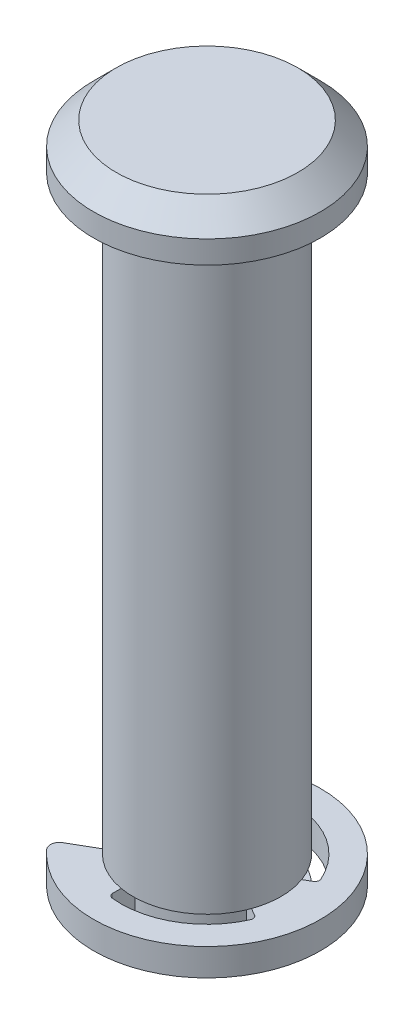
ISO-10303-21;
HEADER;
FILE_DESCRIPTION(('STEP AP214'),'2;1');
FILE_NAME('part.step','',(''),(''),'','','');
FILE_SCHEMA(('AUTOMOTIVE_DESIGN { 1 0 10303 214 1 1 1 1 }'));
ENDSEC;
DATA;
#1=APPLICATION_CONTEXT('core data for automotive mechanical design processes');
#2=APPLICATION_PROTOCOL_DEFINITION('international standard','automotive_design',2000,#1);
#3=PRODUCT_CONTEXT('',#1,'mechanical');
#4=PRODUCT('Part','Part','',(#3));
#5=PRODUCT_RELATED_PRODUCT_CATEGORY('part','',(#4));
#6=PRODUCT_DEFINITION_FORMATION('','',#4);
#7=PRODUCT_DEFINITION_CONTEXT('part definition',#1,'design');
#8=PRODUCT_DEFINITION('design','',#6,#7);
#9=PRODUCT_DEFINITION_SHAPE('','',#8);
#10=(LENGTH_UNIT() NAMED_UNIT(*) SI_UNIT(.MILLI.,.METRE.));
#11=(NAMED_UNIT(*) PLANE_ANGLE_UNIT() SI_UNIT($,.RADIAN.));
#12=(NAMED_UNIT(*) SI_UNIT($,.STERADIAN.) SOLID_ANGLE_UNIT());
#13=UNCERTAINTY_MEASURE_WITH_UNIT(LENGTH_MEASURE(1.E-05),#10,'distance_accuracy_value','');
#14=(GEOMETRIC_REPRESENTATION_CONTEXT(3) GLOBAL_UNCERTAINTY_ASSIGNED_CONTEXT((#13)) GLOBAL_UNIT_ASSIGNED_CONTEXT((#10,
#11,#12)) REPRESENTATION_CONTEXT('',''));
#15=CARTESIAN_POINT('',(0.,0.,0.));
#16=DIRECTION('',(0.,0.,1.));
#17=DIRECTION('',(1.,0.,0.));
#18=AXIS2_PLACEMENT_3D('',#15,#16,#17);
#19=CARTESIAN_POINT('',(0.,-1.524,0.));
#20=DIRECTION('',(0.,-1.,0.));
#21=DIRECTION('',(0.,0.,-1.));
#22=AXIS2_PLACEMENT_3D('',#19,#20,#21);
#23=PLANE('',#22);
#24=CARTESIAN_POINT('',(0.,-1.524,0.));
#25=DIRECTION('',(0.,1.,0.));
#26=DIRECTION('',(0.,0.,1.));
#27=AXIS2_PLACEMENT_3D('',#24,#25,#26);
#28=CIRCLE('',#27,2.0701);
#29=CARTESIAN_POINT('',(0.,-1.524,2.0701));
#30=VERTEX_POINT('',#29);
#31=EDGE_CURVE('P0_E18',#30,#30,#28,.T.);
#32=ORIENTED_EDGE('',*,*,#31,.F.);
#33=EDGE_LOOP('',(#32));
#34=FACE_BOUND('',#33,.T.);
#35=ADVANCED_FACE('P0_F15',(#34),#23,.T.);
#36=CARTESIAN_POINT('',(0.,17.78,0.));
#37=DIRECTION('',(0.,1.,0.));
#38=DIRECTION('',(0.,0.,1.));
#39=AXIS2_PLACEMENT_3D('',#36,#37,#38);
#40=PLANE('',#39);
#41=CARTESIAN_POINT('',(0.,17.7799999999593,0.));
#42=DIRECTION('',(0.,-1.,0.));
#43=DIRECTION('',(0.,0.,-1.));
#44=AXIS2_PLACEMENT_3D('',#41,#42,#43);
#45=CIRCLE('',#44,2.53999999995358);
#46=CARTESIAN_POINT('',(0.,17.7799999999593,-2.53999999995358));
#47=VERTEX_POINT('',#46);
#48=EDGE_CURVE('P0_E42',#47,#47,#45,.T.);
#49=ORIENTED_EDGE('',*,*,#48,.F.);
#50=EDGE_LOOP('',(#49));
#51=FACE_BOUND('',#50,.T.);
#52=ADVANCED_FACE('P0_F53',(#51),#40,.T.);
#53=CARTESIAN_POINT('',(0.,-1.524,0.));
#54=DIRECTION('',(0.,1.,0.));
#55=DIRECTION('',(0.,0.,1.));
#56=AXIS2_PLACEMENT_3D('',#53,#54,#55);
#57=CYLINDRICAL_SURFACE('',#56,2.0701);
#58=ORIENTED_EDGE('',*,*,#31,.T.);
#59=EDGE_LOOP('',(#58));
#60=FACE_BOUND('',#59,.T.);
#61=CARTESIAN_POINT('',(0.,-0.762,0.));
#62=DIRECTION('',(0.,1.,0.));
#63=DIRECTION('',(0.,0.,1.));
#64=AXIS2_PLACEMENT_3D('',#61,#62,#63);
#65=CIRCLE('',#64,2.0701);
#66=CARTESIAN_POINT('',(0.,-0.762,2.0701));
#67=VERTEX_POINT('',#66);
#68=EDGE_CURVE('P0_E40',#67,#67,#65,.F.);
#69=ORIENTED_EDGE('',*,*,#68,.T.);
#70=EDGE_LOOP('',(#69));
#71=FACE_BOUND('',#70,.T.);
#72=ADVANCED_FACE('P0_F49',(#60,#71),#57,.T.);
#73=CARTESIAN_POINT('',(0.,17.1450000000846,0.));
#74=DIRECTION('',(0.,-1.,0.));
#75=DIRECTION('',(0.,0.,-1.));
#76=AXIS2_PLACEMENT_3D('',#73,#74,#75);
#77=CONICAL_SURFACE('',#76,3.17499999988513,0.785398163442207);
#78=ORIENTED_EDGE('',*,*,#48,.T.);
#79=EDGE_LOOP('',(#78));
#80=FACE_BOUND('',#79,.T.);
#81=CARTESIAN_POINT('',(0.,17.145,0.));
#82=DIRECTION('',(0.,-1.,0.));
#83=DIRECTION('',(0.,0.,-1.));
#84=AXIS2_PLACEMENT_3D('',#81,#82,#83);
#85=CIRCLE('',#84,3.175);
#86=CARTESIAN_POINT('',(0.,17.145,-3.175));
#87=VERTEX_POINT('',#86);
#88=EDGE_CURVE('P0_E30',#87,#87,#85,.T.);
#89=ORIENTED_EDGE('',*,*,#88,.F.);
#90=EDGE_LOOP('',(#89));
#91=FACE_BOUND('',#90,.T.);
#92=ADVANCED_FACE('P0_F85',(#80,#91),#77,.T.);
#93=CARTESIAN_POINT('',(0.,-0.762,0.));
#94=DIRECTION('',(0.,-1.,0.));
#95=DIRECTION('',(0.,0.,-1.));
#96=AXIS2_PLACEMENT_3D('',#93,#94,#95);
#97=PLANE('',#96);
#98=ORIENTED_EDGE('',*,*,#68,.F.);
#99=EDGE_LOOP('',(#98));
#100=FACE_BOUND('',#99,.T.);
#101=CARTESIAN_POINT('',(0.,-0.762,0.));
#102=DIRECTION('',(0.,1.,0.));
#103=DIRECTION('',(0.,0.,1.));
#104=AXIS2_PLACEMENT_3D('',#101,#102,#103);
#105=CIRCLE('',#104,1.6891);
#106=CARTESIAN_POINT('',(0.,-0.762,1.6891));
#107=VERTEX_POINT('',#106);
#108=EDGE_CURVE('P0_E37',#107,#107,#105,.T.);
#109=ORIENTED_EDGE('',*,*,#108,.F.);
#110=EDGE_LOOP('',(#109));
#111=FACE_BOUND('',#110,.T.);
#112=ADVANCED_FACE('P0_F81',(#100,#111),#97,.F.);
#113=CARTESIAN_POINT('',(0.,17.78,0.));
#114=DIRECTION('',(0.,-1.,0.));
#115=DIRECTION('',(0.,0.,-1.));
#116=AXIS2_PLACEMENT_3D('',#113,#114,#115);
#117=CYLINDRICAL_SURFACE('',#116,3.175);
#118=ORIENTED_EDGE('',*,*,#88,.T.);
#119=EDGE_LOOP('',(#118));
#120=FACE_BOUND('',#119,.T.);
#121=CARTESIAN_POINT('',(0.,16.51,0.));
#122=DIRECTION('',(0.,-1.,0.));
#123=DIRECTION('',(0.,0.,-1.));
#124=AXIS2_PLACEMENT_3D('',#121,#122,#123);
#125=CIRCLE('',#124,3.175);
#126=CARTESIAN_POINT('',(0.,16.51,-3.175));
#127=VERTEX_POINT('',#126);
#128=EDGE_CURVE('P0_E34',#127,#127,#125,.F.);
#129=ORIENTED_EDGE('',*,*,#128,.T.);
#130=EDGE_LOOP('',(#129));
#131=FACE_BOUND('',#130,.T.);
#132=ADVANCED_FACE('P0_F77',(#120,#131),#117,.T.);
#133=CARTESIAN_POINT('',(0.,-0.762,0.));
#134=DIRECTION('',(0.,1.,0.));
#135=DIRECTION('',(0.,0.,1.));
#136=AXIS2_PLACEMENT_3D('',#133,#134,#135);
#137=CYLINDRICAL_SURFACE('',#136,1.6891);
#138=ORIENTED_EDGE('',*,*,#108,.T.);
#139=EDGE_LOOP('',(#138));
#140=FACE_BOUND('',#139,.T.);
#141=CARTESIAN_POINT('',(0.,0.,0.));
#142=DIRECTION('',(0.,1.,0.));
#143=DIRECTION('',(0.,0.,1.));
#144=AXIS2_PLACEMENT_3D('',#141,#142,#143);
#145=CIRCLE('',#144,1.6891);
#146=CARTESIAN_POINT('',(0.,0.,1.6891));
#147=VERTEX_POINT('',#146);
#148=EDGE_CURVE('P0_E27',#147,#147,#145,.F.);
#149=ORIENTED_EDGE('',*,*,#148,.T.);
#150=EDGE_LOOP('',(#149));
#151=FACE_BOUND('',#150,.T.);
#152=ADVANCED_FACE('P0_F73',(#140,#151),#137,.T.);
#153=CARTESIAN_POINT('',(0.,16.51,0.));
#154=DIRECTION('',(0.,1.,0.));
#155=DIRECTION('',(0.,0.,1.));
#156=AXIS2_PLACEMENT_3D('',#153,#154,#155);
#157=PLANE('',#156);
#158=ORIENTED_EDGE('',*,*,#128,.F.);
#159=EDGE_LOOP('',(#158));
#160=FACE_BOUND('',#159,.T.);
#161=CARTESIAN_POINT('',(0.,16.51,0.));
#162=DIRECTION('',(0.,-1.,0.));
#163=DIRECTION('',(0.,0.,-1.));
#164=AXIS2_PLACEMENT_3D('',#161,#162,#163);
#165=CIRCLE('',#164,2.0701);
#166=CARTESIAN_POINT('',(0.,16.51,-2.0701));
#167=VERTEX_POINT('',#166);
#168=EDGE_CURVE('P0_E22',#167,#167,#165,.T.);
#169=ORIENTED_EDGE('',*,*,#168,.F.);
#170=EDGE_LOOP('',(#169));
#171=FACE_BOUND('',#170,.T.);
#172=ADVANCED_FACE('P0_F66',(#160,#171),#157,.F.);
#173=CARTESIAN_POINT('',(0.,0.,0.));
#174=DIRECTION('',(0.,1.,0.));
#175=DIRECTION('',(0.,0.,1.));
#176=AXIS2_PLACEMENT_3D('',#173,#174,#175);
#177=PLANE('',#176);
#178=CARTESIAN_POINT('',(0.,0.,0.));
#179=DIRECTION('',(0.,-1.,0.));
#180=DIRECTION('',(0.,0.,-1.));
#181=AXIS2_PLACEMENT_3D('',#178,#179,#180);
#182=CIRCLE('',#181,2.0701);
#183=CARTESIAN_POINT('',(0.,0.,-2.0701));
#184=VERTEX_POINT('',#183);
#185=EDGE_CURVE('P0_E10',#184,#184,#182,.F.);
#186=ORIENTED_EDGE('',*,*,#185,.F.);
#187=EDGE_LOOP('',(#186));
#188=FACE_BOUND('',#187,.T.);
#189=ORIENTED_EDGE('',*,*,#148,.F.);
#190=EDGE_LOOP('',(#189));
#191=FACE_BOUND('',#190,.T.);
#192=ADVANCED_FACE('P0_F61',(#188,#191),#177,.F.);
#193=CARTESIAN_POINT('',(0.,16.51,0.));
#194=DIRECTION('',(0.,-1.,0.));
#195=DIRECTION('',(0.,0.,-1.));
#196=AXIS2_PLACEMENT_3D('',#193,#194,#195);
#197=CYLINDRICAL_SURFACE('',#196,2.0701);
#198=ORIENTED_EDGE('',*,*,#185,.T.);
#199=EDGE_LOOP('',(#198));
#200=FACE_BOUND('',#199,.T.);
#201=ORIENTED_EDGE('',*,*,#168,.T.);
#202=EDGE_LOOP('',(#201));
#203=FACE_BOUND('',#202,.T.);
#204=ADVANCED_FACE('P0_F59',(#200,#203),#197,.T.);
#205=CLOSED_SHELL('',(#35,#52,#72,#92,#112,#132,#152,#172,#192,#204));
#206=MANIFOLD_SOLID_BREP('P0_B1',#205);
#207=CARTESIAN_POINT('',(0.,0.,0.));
#208=DIRECTION('',(0.,1.,0.));
#209=DIRECTION('',(0.,0.,1.));
#210=AXIS2_PLACEMENT_3D('',#207,#208,#209);
#211=PLANE('',#210);
#212=CARTESIAN_POINT('',(0.,0.,0.));
#213=DIRECTION('',(0.,-1.,0.));
#214=DIRECTION('',(0.,0.,-1.));
#215=AXIS2_PLACEMENT_3D('',#212,#213,#214);
#216=CIRCLE('',#215,2.413);
#217=CARTESIAN_POINT('',(2.20419365111261,0.,0.981885608609708));
#218=VERTEX_POINT('',#217);
#219=CARTESIAN_POINT('',(-0.251758944889966,0.,2.39983050102875));
#220=VERTEX_POINT('',#219);
#221=EDGE_CURVE('P1_E219',#218,#220,#216,.T.);
#222=ORIENTED_EDGE('',*,*,#221,.T.);
#223=CARTESIAN_POINT('',(-0.238508474106284,0.,2.27352363255355));
#224=DIRECTION('',(0.,-1.,0.));
#225=DIRECTION('',(0.,0.,-1.));
#226=AXIS2_PLACEMENT_3D('',#223,#224,#225);
#227=CIRCLE('',#226,0.127);
#228=CARTESIAN_POINT('',(-0.365508474106284,0.,2.27352363255355));
#229=VERTEX_POINT('',#228);
#230=EDGE_CURVE('P1_E162',#220,#229,#227,.T.);
#231=ORIENTED_EDGE('',*,*,#230,.T.);
#232=DIRECTION('',(0.,0.,1.));
#233=VECTOR('',#232,1.);
#234=CARTESIAN_POINT('',(-0.365508474106284,0.,0.));
#235=LINE('',#234,#233);
#236=CARTESIAN_POINT('',(-0.365508474106281,0.,1.64907924774903));
#237=VERTEX_POINT('',#236);
#238=EDGE_CURVE('P1_E139',#229,#237,#235,.F.);
#239=ORIENTED_EDGE('',*,*,#238,.T.);
#240=CARTESIAN_POINT('',(0.,0.,0.));
#241=DIRECTION('',(0.,-1.,0.));
#242=DIRECTION('',(0.,0.,-1.));
#243=AXIS2_PLACEMENT_3D('',#240,#241,#242);
#244=CIRCLE('',#243,1.6891);
#245=CARTESIAN_POINT('',(-1.24539028435126,0.,1.14107924774902));
#246=VERTEX_POINT('',#245);
#247=EDGE_CURVE('P1_E20',#237,#246,#244,.T.);
#248=ORIENTED_EDGE('',*,*,#247,.T.);
#249=DIRECTION('',(-0.866025403784438,0.,0.500000000000001));
#250=VECTOR('',#249,1.);
#251=CARTESIAN_POINT('',(-1.24539028435126,0.,1.14107924774902));
#252=LINE('',#251,#250);
#253=CARTESIAN_POINT('',(-2.28935775229583,0.,1.74381414639204));
#254=VERTEX_POINT('',#253);
#255=EDGE_CURVE('P1_E146',#246,#254,#252,.T.);
#256=ORIENTED_EDGE('',*,*,#255,.T.);
#257=CARTESIAN_POINT('',(-2.16235775229583,0.,1.96378459895328));
#258=DIRECTION('',(0.,-1.,0.));
#259=DIRECTION('',(0.,0.,-1.));
#260=AXIS2_PLACEMENT_3D('',#257,#258,#259);
#261=CIRCLE('',#260,0.254);
#262=CARTESIAN_POINT('',(-2.35038886119112,0.,2.13454847712313));
#263=VERTEX_POINT('',#262);
#264=EDGE_CURVE('P1_E160',#254,#263,#261,.F.);
#265=ORIENTED_EDGE('',*,*,#264,.T.);
#266=CARTESIAN_POINT('',(0.,0.,0.));
#267=DIRECTION('',(0.,-1.,0.));
#268=DIRECTION('',(0.,0.,-1.));
#269=AXIS2_PLACEMENT_3D('',#266,#267,#268);
#270=CIRCLE('',#269,3.175);
#271=CARTESIAN_POINT('',(-2.35038886119112,0.,-2.13454847712313));
#272=VERTEX_POINT('',#271);
#273=EDGE_CURVE('P1_E243',#272,#263,#270,.T.);
#274=ORIENTED_EDGE('',*,*,#273,.F.);
#275=CARTESIAN_POINT('',(-2.16235775229583,0.,-1.96378459895328));
#276=DIRECTION('',(0.,-1.,0.));
#277=DIRECTION('',(0.,0.,-1.));
#278=AXIS2_PLACEMENT_3D('',#275,#276,#277);
#279=CIRCLE('',#278,0.254);
#280=CARTESIAN_POINT('',(-2.28935775229583,0.,-1.74381414639204));
#281=VERTEX_POINT('',#280);
#282=EDGE_CURVE('P1_E241',#281,#272,#279,.T.);
#283=ORIENTED_EDGE('',*,*,#282,.F.);
#284=DIRECTION('',(-0.866025403784438,0.,-0.500000000000001));
#285=VECTOR('',#284,1.);
#286=CARTESIAN_POINT('',(-1.24539028435126,0.,-1.14107924774902));
#287=LINE('',#286,#285);
#288=CARTESIAN_POINT('',(-1.24539028435126,0.,-1.14107924774902));
#289=VERTEX_POINT('',#288);
#290=EDGE_CURVE('P1_E182',#281,#289,#287,.F.);
#291=ORIENTED_EDGE('',*,*,#290,.T.);
#292=CARTESIAN_POINT('',(0.,0.,0.));
#293=DIRECTION('',(0.,-1.,0.));
#294=DIRECTION('',(0.,0.,-1.));
#295=AXIS2_PLACEMENT_3D('',#292,#293,#294);
#296=CIRCLE('',#295,1.6891);
#297=CARTESIAN_POINT('',(-0.365508474106277,0.,-1.64907924774903));
#298=VERTEX_POINT('',#297);
#299=EDGE_CURVE('P1_E238',#289,#298,#296,.T.);
#300=ORIENTED_EDGE('',*,*,#299,.T.);
#301=DIRECTION('',(0.,0.,1.));
#302=VECTOR('',#301,1.);
#303=CARTESIAN_POINT('',(-0.365508474106277,0.,-1.64907924774903));
#304=LINE('',#303,#302);
#305=CARTESIAN_POINT('',(-0.365508474106284,0.,-2.27352363255355));
#306=VERTEX_POINT('',#305);
#307=EDGE_CURVE('P1_E177',#298,#306,#304,.F.);
#308=ORIENTED_EDGE('',*,*,#307,.T.);
#309=CARTESIAN_POINT('',(-0.238508474106284,0.,-2.27352363255355));
#310=DIRECTION('',(0.,-1.,0.));
#311=DIRECTION('',(0.,0.,-1.));
#312=AXIS2_PLACEMENT_3D('',#309,#310,#311);
#313=CIRCLE('',#312,0.127);
#314=CARTESIAN_POINT('',(-0.251758944889966,0.,-2.39983050102875));
#315=VERTEX_POINT('',#314);
#316=EDGE_CURVE('P1_E180',#306,#315,#313,.T.);
#317=ORIENTED_EDGE('',*,*,#316,.T.);
#318=CARTESIAN_POINT('',(0.,0.,0.));
#319=DIRECTION('',(0.,-1.,0.));
#320=DIRECTION('',(0.,0.,-1.));
#321=AXIS2_PLACEMENT_3D('',#318,#319,#320);
#322=CIRCLE('',#321,2.413);
#323=CARTESIAN_POINT('',(2.20419365111261,0.,-0.981885608609708));
#324=VERTEX_POINT('',#323);
#325=EDGE_CURVE('P1_E231',#315,#324,#322,.T.);
#326=ORIENTED_EDGE('',*,*,#325,.T.);
#327=CARTESIAN_POINT('',(2.08818345894879,0.,-0.930207418682882));
#328=DIRECTION('',(0.,-1.,0.));
#329=DIRECTION('',(0.,0.,-1.));
#330=AXIS2_PLACEMENT_3D('',#327,#328,#329);
#331=CIRCLE('',#330,0.127);
#332=CARTESIAN_POINT('',(2.15168345894879,0.,-0.820222192402257));
#333=VERTEX_POINT('',#332);
#334=EDGE_CURVE('P1_E228',#324,#333,#331,.T.);
#335=ORIENTED_EDGE('',*,*,#334,.T.);
#336=DIRECTION('',(0.866025403784441,0.,-0.499999999999995));
#337=VECTOR('',#336,1.);
#338=CARTESIAN_POINT('',(2.248360544295,0.,-0.876038733651361));
#339=LINE('',#338,#337);
#340=CARTESIAN_POINT('',(1.61089875845753,0.,-0.508));
#341=VERTEX_POINT('',#340);
#342=EDGE_CURVE('P1_E173',#333,#341,#339,.F.);
#343=ORIENTED_EDGE('',*,*,#342,.T.);
#344=CARTESIAN_POINT('',(0.,0.,0.));
#345=DIRECTION('',(0.,-1.,0.));
#346=DIRECTION('',(0.,0.,-1.));
#347=AXIS2_PLACEMENT_3D('',#344,#345,#346);
#348=CIRCLE('',#347,1.6891);
#349=CARTESIAN_POINT('',(1.61089875845753,0.,0.508));
#350=VERTEX_POINT('',#349);
#351=EDGE_CURVE('P1_E225',#341,#350,#348,.T.);
#352=ORIENTED_EDGE('',*,*,#351,.T.);
#353=DIRECTION('',(-0.866025403784441,0.,-0.499999999999995));
#354=VECTOR('',#353,1.);
#355=CARTESIAN_POINT('',(2.248360544295,0.,0.876038733651361));
#356=LINE('',#355,#354);
#357=CARTESIAN_POINT('',(2.15168345894879,0.,0.820222192402257));
#358=VERTEX_POINT('',#357);
#359=EDGE_CURVE('P1_E168',#350,#358,#356,.F.);
#360=ORIENTED_EDGE('',*,*,#359,.T.);
#361=CARTESIAN_POINT('',(2.08818345894879,0.,0.930207418682881));
#362=DIRECTION('',(0.,-1.,0.));
#363=DIRECTION('',(0.,0.,-1.));
#364=AXIS2_PLACEMENT_3D('',#361,#362,#363);
#365=CIRCLE('',#364,0.127);
#366=EDGE_CURVE('P1_E171',#358,#218,#365,.T.);
#367=ORIENTED_EDGE('',*,*,#366,.T.);
#368=EDGE_LOOP('',(#222,#231,#239,#248,#256,#265,#274,#283,#291,#300,#308,#317,#326,#335,#343,
#352,#360,#367));
#369=FACE_BOUND('',#368,.T.);
#370=ADVANCED_FACE('P1_F17',(#369),#211,.T.);
#371=CARTESIAN_POINT('',(0.,0.,0.));
#372=DIRECTION('',(0.,-1.,0.));
#373=DIRECTION('',(0.,0.,-1.));
#374=AXIS2_PLACEMENT_3D('',#371,#372,#373);
#375=CYLINDRICAL_SURFACE('',#374,3.175);
#376=CARTESIAN_POINT('',(0.,-0.762,0.));
#377=DIRECTION('',(0.,-1.,0.));
#378=DIRECTION('',(0.,0.,-1.));
#379=AXIS2_PLACEMENT_3D('',#376,#377,#378);
#380=CIRCLE('',#379,3.175);
#381=CARTESIAN_POINT('',(-2.35038886119112,-0.762,2.13454847712313));
#382=VERTEX_POINT('',#381);
#383=CARTESIAN_POINT('',(-2.35038886119112,-0.762,-2.13454847712313));
#384=VERTEX_POINT('',#383);
#385=EDGE_CURVE('P1_E217',#382,#384,#380,.F.);
#386=ORIENTED_EDGE('',*,*,#385,.T.);
#387=DIRECTION('',(0.,-1.,0.));
#388=VECTOR('',#387,1.);
#389=CARTESIAN_POINT('',(-2.35038886119112,0.,-2.13454847712313));
#390=LINE('',#389,#388);
#391=EDGE_CURVE('P1_E165',#272,#384,#390,.T.);
#392=ORIENTED_EDGE('',*,*,#391,.F.);
#393=ORIENTED_EDGE('',*,*,#273,.T.);
#394=DIRECTION('',(0.,-1.,0.));
#395=VECTOR('',#394,1.);
#396=CARTESIAN_POINT('',(-2.35038886119112,0.,2.13454847712313));
#397=LINE('',#396,#395);
#398=EDGE_CURVE('P1_E156',#382,#263,#397,.F.);
#399=ORIENTED_EDGE('',*,*,#398,.F.);
#400=EDGE_LOOP('',(#386,#392,#393,#399));
#401=FACE_BOUND('',#400,.T.);
#402=ADVANCED_FACE('P1_F303',(#401),#375,.T.);
#403=CARTESIAN_POINT('',(-2.16235775229583,0.,-1.96378459895328));
#404=DIRECTION('',(0.,-1.,0.));
#405=DIRECTION('',(0.,0.,-1.));
#406=AXIS2_PLACEMENT_3D('',#403,#404,#405);
#407=CYLINDRICAL_SURFACE('',#406,0.254);
#408=ORIENTED_EDGE('',*,*,#282,.T.);
#409=ORIENTED_EDGE('',*,*,#391,.T.);
#410=CARTESIAN_POINT('',(-2.16235775229583,-0.762,-1.96378459895328));
#411=DIRECTION('',(0.,-1.,0.));
#412=DIRECTION('',(0.,0.,-1.));
#413=AXIS2_PLACEMENT_3D('',#410,#411,#412);
#414=CIRCLE('',#413,0.254);
#415=CARTESIAN_POINT('',(-2.28935775229583,-0.762,-1.74381414639204));
#416=VERTEX_POINT('',#415);
#417=EDGE_CURVE('P1_E214',#384,#416,#414,.F.);
#418=ORIENTED_EDGE('',*,*,#417,.T.);
#419=DIRECTION('',(0.,1.,0.));
#420=VECTOR('',#419,1.);
#421=CARTESIAN_POINT('',(-2.28935775229583,0.,-1.74381414639204));
#422=LINE('',#421,#420);
#423=EDGE_CURVE('P1_E183',#416,#281,#422,.T.);
#424=ORIENTED_EDGE('',*,*,#423,.T.);
#425=EDGE_LOOP('',(#408,#409,#418,#424));
#426=FACE_BOUND('',#425,.T.);
#427=ADVANCED_FACE('P1_F282',(#426),#407,.T.);
#428=CARTESIAN_POINT('',(-1.24539028435126,0.,-1.14107924774902));
#429=DIRECTION('',(0.500000000000001,0.,-0.866025403784438));
#430=DIRECTION('',(-0.866025403784438,0.,-0.500000000000001));
#431=AXIS2_PLACEMENT_3D('',#428,#429,#430);
#432=PLANE('',#431);
#433=DIRECTION('',(0.866025403784438,0.,0.500000000000001));
#434=VECTOR('',#433,1.);
#435=CARTESIAN_POINT('',(-2.28935775229583,-0.762,-1.74381414639204));
#436=LINE('',#435,#434);
#437=CARTESIAN_POINT('',(-1.24539028435126,-0.762,-1.14107924774902));
#438=VERTEX_POINT('',#437);
#439=EDGE_CURVE('P1_E213',#416,#438,#436,.T.);
#440=ORIENTED_EDGE('',*,*,#439,.T.);
#441=DIRECTION('',(0.,-1.,0.));
#442=VECTOR('',#441,1.);
#443=CARTESIAN_POINT('',(-1.24539028435126,0.,-1.14107924774902));
#444=LINE('',#443,#442);
#445=EDGE_CURVE('P1_E240',#438,#289,#444,.F.);
#446=ORIENTED_EDGE('',*,*,#445,.T.);
#447=ORIENTED_EDGE('',*,*,#290,.F.);
#448=ORIENTED_EDGE('',*,*,#423,.F.);
#449=EDGE_LOOP('',(#440,#446,#447,#448));
#450=FACE_BOUND('',#449,.T.);
#451=ADVANCED_FACE('P1_F290',(#450),#432,.F.);
#452=CARTESIAN_POINT('',(0.,0.,0.));
#453=DIRECTION('',(0.,-1.,0.));
#454=DIRECTION('',(0.,0.,-1.));
#455=AXIS2_PLACEMENT_3D('',#452,#453,#454);
#456=CYLINDRICAL_SURFACE('',#455,1.6891);
#457=ORIENTED_EDGE('',*,*,#299,.F.);
#458=ORIENTED_EDGE('',*,*,#445,.F.);
#459=CARTESIAN_POINT('',(0.,-0.762,0.));
#460=DIRECTION('',(0.,-1.,0.));
#461=DIRECTION('',(0.,0.,-1.));
#462=AXIS2_PLACEMENT_3D('',#459,#460,#461);
#463=CIRCLE('',#462,1.6891);
#464=CARTESIAN_POINT('',(-0.365508474106277,-0.762,-1.64907924774903));
#465=VERTEX_POINT('',#464);
#466=EDGE_CURVE('P1_E210',#438,#465,#463,.T.);
#467=ORIENTED_EDGE('',*,*,#466,.T.);
#468=DIRECTION('',(0.,1.,0.));
#469=VECTOR('',#468,1.);
#470=CARTESIAN_POINT('',(-0.365508474106277,0.,-1.64907924774903));
#471=LINE('',#470,#469);
#472=EDGE_CURVE('P1_E181',#465,#298,#471,.T.);
#473=ORIENTED_EDGE('',*,*,#472,.T.);
#474=EDGE_LOOP('',(#457,#458,#467,#473));
#475=FACE_BOUND('',#474,.T.);
#476=ADVANCED_FACE('P1_F308',(#475),#456,.F.);
#477=CARTESIAN_POINT('',(-0.365508474106277,0.,-1.64907924774903));
#478=DIRECTION('',(-1.,0.,0.));
#479=DIRECTION('',(0.,0.,1.));
#480=AXIS2_PLACEMENT_3D('',#477,#478,#479);
#481=PLANE('',#480);
#482=ORIENTED_EDGE('',*,*,#307,.F.);
#483=ORIENTED_EDGE('',*,*,#472,.F.);
#484=DIRECTION('',(0.,0.,1.));
#485=VECTOR('',#484,1.);
#486=CARTESIAN_POINT('',(-0.365508474106277,-0.762,0.));
#487=LINE('',#486,#485);
#488=CARTESIAN_POINT('',(-0.36550847410628,-0.762,-2.27352363255355));
#489=VERTEX_POINT('',#488);
#490=EDGE_CURVE('P1_E209',#465,#489,#487,.F.);
#491=ORIENTED_EDGE('',*,*,#490,.T.);
#492=DIRECTION('',(0.,-1.,0.));
#493=VECTOR('',#492,1.);
#494=CARTESIAN_POINT('',(-0.365508474106284,0.,-2.27352363255355));
#495=LINE('',#494,#493);
#496=EDGE_CURVE('P1_E237',#489,#306,#495,.F.);
#497=ORIENTED_EDGE('',*,*,#496,.T.);
#498=EDGE_LOOP('',(#482,#483,#491,#497));
#499=FACE_BOUND('',#498,.T.);
#500=ADVANCED_FACE('P1_F311',(#499),#481,.F.);
#501=CARTESIAN_POINT('',(-0.238508474106284,0.,-2.27352363255355));
#502=DIRECTION('',(0.,-1.,0.));
#503=DIRECTION('',(0.,0.,-1.));
#504=AXIS2_PLACEMENT_3D('',#501,#502,#503);
#505=CYLINDRICAL_SURFACE('',#504,0.127);
#506=CARTESIAN_POINT('',(-0.238508474106284,-0.762,-2.27352363255355));
#507=DIRECTION('',(0.,-1.,0.));
#508=DIRECTION('',(0.,0.,-1.));
#509=AXIS2_PLACEMENT_3D('',#506,#507,#508);
#510=CIRCLE('',#509,0.127);
#511=CARTESIAN_POINT('',(-0.251758944889966,-0.762,-2.39983050102875));
#512=VERTEX_POINT('',#511);
#513=EDGE_CURVE('P1_E206',#489,#512,#510,.T.);
#514=ORIENTED_EDGE('',*,*,#513,.T.);
#515=DIRECTION('',(0.,-1.,0.));
#516=VECTOR('',#515,1.);
#517=CARTESIAN_POINT('',(-0.251758944889966,0.,-2.39983050102875));
#518=LINE('',#517,#516);
#519=EDGE_CURVE('P1_E234',#512,#315,#518,.F.);
#520=ORIENTED_EDGE('',*,*,#519,.T.);
#521=ORIENTED_EDGE('',*,*,#316,.F.);
#522=ORIENTED_EDGE('',*,*,#496,.F.);
#523=EDGE_LOOP('',(#514,#520,#521,#522));
#524=FACE_BOUND('',#523,.T.);
#525=ADVANCED_FACE('P1_F316',(#524),#505,.F.);
#526=CARTESIAN_POINT('',(0.,0.,0.));
#527=DIRECTION('',(0.,-1.,0.));
#528=DIRECTION('',(0.,0.,-1.));
#529=AXIS2_PLACEMENT_3D('',#526,#527,#528);
#530=CYLINDRICAL_SURFACE('',#529,2.413);
#531=ORIENTED_EDGE('',*,*,#325,.F.);
#532=ORIENTED_EDGE('',*,*,#519,.F.);
#533=CARTESIAN_POINT('',(0.,-0.762,0.));
#534=DIRECTION('',(0.,-1.,0.));
#535=DIRECTION('',(0.,0.,-1.));
#536=AXIS2_PLACEMENT_3D('',#533,#534,#535);
#537=CIRCLE('',#536,2.413);
#538=CARTESIAN_POINT('',(2.20419365111261,-0.762,-0.981885608609708));
#539=VERTEX_POINT('',#538);
#540=EDGE_CURVE('P1_E204',#512,#539,#537,.T.);
#541=ORIENTED_EDGE('',*,*,#540,.T.);
#542=DIRECTION('',(0.,-1.,0.));
#543=VECTOR('',#542,1.);
#544=CARTESIAN_POINT('',(2.20419365111261,0.,-0.981885608609708));
#545=LINE('',#544,#543);
#546=EDGE_CURVE('P1_E176',#539,#324,#545,.F.);
#547=ORIENTED_EDGE('',*,*,#546,.T.);
#548=EDGE_LOOP('',(#531,#532,#541,#547));
#549=FACE_BOUND('',#548,.T.);
#550=ADVANCED_FACE('P1_F319',(#549),#530,.F.);
#551=CARTESIAN_POINT('',(2.08818345894879,0.,-0.930207418682882));
#552=DIRECTION('',(0.,-1.,0.));
#553=DIRECTION('',(0.,0.,-1.));
#554=AXIS2_PLACEMENT_3D('',#551,#552,#553);
#555=CYLINDRICAL_SURFACE('',#554,0.127);
#556=CARTESIAN_POINT('',(2.08818345894879,-0.762,-0.930207418682882));
#557=DIRECTION('',(0.,-1.,0.));
#558=DIRECTION('',(0.,0.,-1.));
#559=AXIS2_PLACEMENT_3D('',#556,#557,#558);
#560=CIRCLE('',#559,0.127);
#561=CARTESIAN_POINT('',(2.15168345894879,-0.762,-0.820222192402257));
#562=VERTEX_POINT('',#561);
#563=EDGE_CURVE('P1_E201',#539,#562,#560,.T.);
#564=ORIENTED_EDGE('',*,*,#563,.T.);
#565=DIRECTION('',(0.,1.,0.));
#566=VECTOR('',#565,1.);
#567=CARTESIAN_POINT('',(2.15168345894879,0.,-0.820222192402257));
#568=LINE('',#567,#566);
#569=EDGE_CURVE('P1_E175',#562,#333,#568,.T.);
#570=ORIENTED_EDGE('',*,*,#569,.T.);
#571=ORIENTED_EDGE('',*,*,#334,.F.);
#572=ORIENTED_EDGE('',*,*,#546,.F.);
#573=EDGE_LOOP('',(#564,#570,#571,#572));
#574=FACE_BOUND('',#573,.T.);
#575=ADVANCED_FACE('P1_F321',(#574),#555,.F.);
#576=CARTESIAN_POINT('',(2.248360544295,0.,-0.876038733651361));
#577=DIRECTION('',(0.499999999999995,0.,0.866025403784441));
#578=DIRECTION('',(0.866025403784441,0.,-0.499999999999995));
#579=AXIS2_PLACEMENT_3D('',#576,#577,#578);
#580=PLANE('',#579);
#581=DIRECTION('',(-0.866025403784441,0.,0.499999999999995));
#582=VECTOR('',#581,1.);
#583=CARTESIAN_POINT('',(2.15168345894879,-0.762,-0.820222192402257));
#584=LINE('',#583,#582);
#585=CARTESIAN_POINT('',(1.61089875845753,-0.762,-0.508));
#586=VERTEX_POINT('',#585);
#587=EDGE_CURVE('P1_E200',#562,#586,#584,.T.);
#588=ORIENTED_EDGE('',*,*,#587,.T.);
#589=DIRECTION('',(0.,-1.,0.));
#590=VECTOR('',#589,1.);
#591=CARTESIAN_POINT('',(1.61089875845753,0.,-0.508));
#592=LINE('',#591,#590);
#593=EDGE_CURVE('P1_E227',#586,#341,#592,.F.);
#594=ORIENTED_EDGE('',*,*,#593,.T.);
#595=ORIENTED_EDGE('',*,*,#342,.F.);
#596=ORIENTED_EDGE('',*,*,#569,.F.);
#597=EDGE_LOOP('',(#588,#594,#595,#596));
#598=FACE_BOUND('',#597,.T.);
#599=ADVANCED_FACE('P1_F343',(#598),#580,.F.);
#600=CARTESIAN_POINT('',(0.,0.,0.));
#601=DIRECTION('',(0.,-1.,0.));
#602=DIRECTION('',(0.,0.,-1.));
#603=AXIS2_PLACEMENT_3D('',#600,#601,#602);
#604=CYLINDRICAL_SURFACE('',#603,1.6891);
#605=ORIENTED_EDGE('',*,*,#351,.F.);
#606=ORIENTED_EDGE('',*,*,#593,.F.);
#607=CARTESIAN_POINT('',(0.,-0.762,0.));
#608=DIRECTION('',(0.,-1.,0.));
#609=DIRECTION('',(0.,0.,-1.));
#610=AXIS2_PLACEMENT_3D('',#607,#608,#609);
#611=CIRCLE('',#610,1.6891);
#612=CARTESIAN_POINT('',(1.61089875845753,-0.762,0.508));
#613=VERTEX_POINT('',#612);
#614=EDGE_CURVE('P1_E197',#586,#613,#611,.T.);
#615=ORIENTED_EDGE('',*,*,#614,.T.);
#616=DIRECTION('',(0.,1.,0.));
#617=VECTOR('',#616,1.);
#618=CARTESIAN_POINT('',(1.61089875845753,0.,0.508));
#619=LINE('',#618,#617);
#620=EDGE_CURVE('P1_E172',#613,#350,#619,.T.);
#621=ORIENTED_EDGE('',*,*,#620,.T.);
#622=EDGE_LOOP('',(#605,#606,#615,#621));
#623=FACE_BOUND('',#622,.T.);
#624=ADVANCED_FACE('P1_F342',(#623),#604,.F.);
#625=CARTESIAN_POINT('',(2.248360544295,0.,0.876038733651361));
#626=DIRECTION('',(0.499999999999995,0.,-0.866025403784441));
#627=DIRECTION('',(-0.866025403784441,0.,-0.499999999999995));
#628=AXIS2_PLACEMENT_3D('',#625,#626,#627);
#629=PLANE('',#628);
#630=ORIENTED_EDGE('',*,*,#359,.F.);
#631=ORIENTED_EDGE('',*,*,#620,.F.);
#632=DIRECTION('',(0.866025403784442,0.,0.499999999999995));
#633=VECTOR('',#632,1.);
#634=CARTESIAN_POINT('',(1.61089875845753,-0.762,0.508));
#635=LINE('',#634,#633);
#636=CARTESIAN_POINT('',(2.15168345894879,-0.762,0.820222192402257));
#637=VERTEX_POINT('',#636);
#638=EDGE_CURVE('P1_E196',#613,#637,#635,.T.);
#639=ORIENTED_EDGE('',*,*,#638,.T.);
#640=DIRECTION('',(0.,-1.,0.));
#641=VECTOR('',#640,1.);
#642=CARTESIAN_POINT('',(2.15168345894879,0.,0.820222192402257));
#643=LINE('',#642,#641);
#644=EDGE_CURVE('P1_E224',#637,#358,#643,.F.);
#645=ORIENTED_EDGE('',*,*,#644,.T.);
#646=EDGE_LOOP('',(#630,#631,#639,#645));
#647=FACE_BOUND('',#646,.T.);
#648=ADVANCED_FACE('P1_F339',(#647),#629,.F.);
#649=CARTESIAN_POINT('',(2.08818345894879,0.,0.930207418682881));
#650=DIRECTION('',(0.,-1.,0.));
#651=DIRECTION('',(0.,0.,-1.));
#652=AXIS2_PLACEMENT_3D('',#649,#650,#651);
#653=CYLINDRICAL_SURFACE('',#652,0.127);
#654=CARTESIAN_POINT('',(2.08818345894879,-0.762,0.930207418682881));
#655=DIRECTION('',(0.,-1.,0.));
#656=DIRECTION('',(0.,0.,-1.));
#657=AXIS2_PLACEMENT_3D('',#654,#655,#656);
#658=CIRCLE('',#657,0.127);
#659=CARTESIAN_POINT('',(2.20419365111261,-0.762,0.981885608609708));
#660=VERTEX_POINT('',#659);
#661=EDGE_CURVE('P1_E193',#637,#660,#658,.T.);
#662=ORIENTED_EDGE('',*,*,#661,.T.);
#663=DIRECTION('',(0.,-1.,0.));
#664=VECTOR('',#663,1.);
#665=CARTESIAN_POINT('',(2.20419365111261,0.,0.981885608609708));
#666=LINE('',#665,#664);
#667=EDGE_CURVE('P1_E222',#660,#218,#666,.F.);
#668=ORIENTED_EDGE('',*,*,#667,.T.);
#669=ORIENTED_EDGE('',*,*,#366,.F.);
#670=ORIENTED_EDGE('',*,*,#644,.F.);
#671=EDGE_LOOP('',(#662,#668,#669,#670));
#672=FACE_BOUND('',#671,.T.);
#673=ADVANCED_FACE('P1_F336',(#672),#653,.F.);
#674=CARTESIAN_POINT('',(0.,0.,0.));
#675=DIRECTION('',(0.,-1.,0.));
#676=DIRECTION('',(0.,0.,-1.));
#677=AXIS2_PLACEMENT_3D('',#674,#675,#676);
#678=CYLINDRICAL_SURFACE('',#677,2.413);
#679=ORIENTED_EDGE('',*,*,#221,.F.);
#680=ORIENTED_EDGE('',*,*,#667,.F.);
#681=CARTESIAN_POINT('',(0.,-0.762,0.));
#682=DIRECTION('',(0.,-1.,0.));
#683=DIRECTION('',(0.,0.,-1.));
#684=AXIS2_PLACEMENT_3D('',#681,#682,#683);
#685=CIRCLE('',#684,2.413);
#686=CARTESIAN_POINT('',(-0.251758944889966,-0.762,2.39983050102875));
#687=VERTEX_POINT('',#686);
#688=EDGE_CURVE('P1_E190',#660,#687,#685,.T.);
#689=ORIENTED_EDGE('',*,*,#688,.T.);
#690=DIRECTION('',(0.,-1.,0.));
#691=VECTOR('',#690,1.);
#692=CARTESIAN_POINT('',(-0.251758944889966,0.,2.39983050102875));
#693=LINE('',#692,#691);
#694=EDGE_CURVE('P1_E221',#687,#220,#693,.F.);
#695=ORIENTED_EDGE('',*,*,#694,.T.);
#696=EDGE_LOOP('',(#679,#680,#689,#695));
#697=FACE_BOUND('',#696,.T.);
#698=ADVANCED_FACE('P1_F334',(#697),#678,.F.);
#699=CARTESIAN_POINT('',(-0.238508474106284,0.,2.27352363255355));
#700=DIRECTION('',(0.,-1.,0.));
#701=DIRECTION('',(0.,0.,-1.));
#702=AXIS2_PLACEMENT_3D('',#699,#700,#701);
#703=CYLINDRICAL_SURFACE('',#702,0.127);
#704=CARTESIAN_POINT('',(-0.238508474106284,-0.762,2.27352363255355));
#705=DIRECTION('',(0.,-1.,0.));
#706=DIRECTION('',(0.,0.,-1.));
#707=AXIS2_PLACEMENT_3D('',#704,#705,#706);
#708=CIRCLE('',#707,0.127);
#709=CARTESIAN_POINT('',(-0.365508474106284,-0.762,2.27352363255355));
#710=VERTEX_POINT('',#709);
#711=EDGE_CURVE('P1_E187',#687,#710,#708,.T.);
#712=ORIENTED_EDGE('',*,*,#711,.T.);
#713=DIRECTION('',(0.,1.,0.));
#714=VECTOR('',#713,1.);
#715=CARTESIAN_POINT('',(-0.365508474106284,0.,2.27352363255355));
#716=LINE('',#715,#714);
#717=EDGE_CURVE('P1_E249',#710,#229,#716,.T.);
#718=ORIENTED_EDGE('',*,*,#717,.T.);
#719=ORIENTED_EDGE('',*,*,#230,.F.);
#720=ORIENTED_EDGE('',*,*,#694,.F.);
#721=EDGE_LOOP('',(#712,#718,#719,#720));
#722=FACE_BOUND('',#721,.T.);
#723=ADVANCED_FACE('P1_F250',(#722),#703,.F.);
#724=CARTESIAN_POINT('',(-0.365508474106277,0.,1.64907924774903));
#725=DIRECTION('',(-1.,0.,0.));
#726=DIRECTION('',(0.,0.,1.));
#727=AXIS2_PLACEMENT_3D('',#724,#725,#726);
#728=PLANE('',#727);
#729=DIRECTION('',(0.,0.,1.));
#730=VECTOR('',#729,1.);
#731=CARTESIAN_POINT('',(-0.365508474106284,-0.762,0.));
#732=LINE('',#731,#730);
#733=CARTESIAN_POINT('',(-0.365508474106281,-0.762,1.64907924774903));
#734=VERTEX_POINT('',#733);
#735=EDGE_CURVE('P1_E186',#710,#734,#732,.F.);
#736=ORIENTED_EDGE('',*,*,#735,.T.);
#737=DIRECTION('',(0.,-1.,0.));
#738=VECTOR('',#737,1.);
#739=CARTESIAN_POINT('',(-0.365508474106279,0.,1.64907924774903));
#740=LINE('',#739,#738);
#741=EDGE_CURVE('P1_E157',#734,#237,#740,.F.);
#742=ORIENTED_EDGE('',*,*,#741,.T.);
#743=ORIENTED_EDGE('',*,*,#238,.F.);
#744=ORIENTED_EDGE('',*,*,#717,.F.);
#745=EDGE_LOOP('',(#736,#742,#743,#744));
#746=FACE_BOUND('',#745,.T.);
#747=ADVANCED_FACE('P1_F256',(#746),#728,.F.);
#748=CARTESIAN_POINT('',(0.,0.,0.));
#749=DIRECTION('',(0.,-1.,0.));
#750=DIRECTION('',(0.,0.,-1.));
#751=AXIS2_PLACEMENT_3D('',#748,#749,#750);
#752=CYLINDRICAL_SURFACE('',#751,1.6891);
#753=ORIENTED_EDGE('',*,*,#247,.F.);
#754=ORIENTED_EDGE('',*,*,#741,.F.);
#755=CARTESIAN_POINT('',(0.,-0.762,0.));
#756=DIRECTION('',(0.,-1.,0.));
#757=DIRECTION('',(0.,0.,-1.));
#758=AXIS2_PLACEMENT_3D('',#755,#756,#757);
#759=CIRCLE('',#758,1.6891);
#760=CARTESIAN_POINT('',(-1.24539028435126,-0.762,1.14107924774902));
#761=VERTEX_POINT('',#760);
#762=EDGE_CURVE('P1_E152',#734,#761,#759,.T.);
#763=ORIENTED_EDGE('',*,*,#762,.T.);
#764=DIRECTION('',(0.,1.,0.));
#765=VECTOR('',#764,1.);
#766=CARTESIAN_POINT('',(-1.24539028435126,0.,1.14107924774902));
#767=LINE('',#766,#765);
#768=EDGE_CURVE('P1_E149',#761,#246,#767,.T.);
#769=ORIENTED_EDGE('',*,*,#768,.T.);
#770=EDGE_LOOP('',(#753,#754,#763,#769));
#771=FACE_BOUND('',#770,.T.);
#772=ADVANCED_FACE('P1_F150',(#771),#752,.F.);
#773=CARTESIAN_POINT('',(-1.88285207018874,0.,1.50911798140039));
#774=DIRECTION('',(0.500000000000001,0.,0.866025403784438));
#775=DIRECTION('',(0.866025403784438,0.,-0.500000000000001));
#776=AXIS2_PLACEMENT_3D('',#773,#774,#775);
#777=PLANE('',#776);
#778=ORIENTED_EDGE('',*,*,#255,.F.);
#779=ORIENTED_EDGE('',*,*,#768,.F.);
#780=DIRECTION('',(-0.866025403784438,0.,0.500000000000001));
#781=VECTOR('',#780,1.);
#782=CARTESIAN_POINT('',(-1.24539028435126,-0.762,1.14107924774902));
#783=LINE('',#782,#781);
#784=CARTESIAN_POINT('',(-2.28935775229583,-0.762,1.74381414639204));
#785=VERTEX_POINT('',#784);
#786=EDGE_CURVE('P1_E26',#761,#785,#783,.T.);
#787=ORIENTED_EDGE('',*,*,#786,.T.);
#788=DIRECTION('',(0.,-1.,0.));
#789=VECTOR('',#788,1.);
#790=CARTESIAN_POINT('',(-2.28935775229583,0.,1.74381414639204));
#791=LINE('',#790,#789);
#792=EDGE_CURVE('P1_E34',#254,#785,#791,.T.);
#793=ORIENTED_EDGE('',*,*,#792,.F.);
#794=EDGE_LOOP('',(#778,#779,#787,#793));
#795=FACE_BOUND('',#794,.T.);
#796=ADVANCED_FACE('P1_F159',(#795),#777,.F.);
#797=CARTESIAN_POINT('',(-2.16235775229583,0.,1.96378459895328));
#798=DIRECTION('',(0.,-1.,0.));
#799=DIRECTION('',(0.,0.,-1.));
#800=AXIS2_PLACEMENT_3D('',#797,#798,#799);
#801=CYLINDRICAL_SURFACE('',#800,0.254);
#802=ORIENTED_EDGE('',*,*,#264,.F.);
#803=ORIENTED_EDGE('',*,*,#792,.T.);
#804=CARTESIAN_POINT('',(-2.16235775229583,-0.762,1.96378459895328));
#805=DIRECTION('',(0.,-1.,0.));
#806=DIRECTION('',(0.,0.,-1.));
#807=AXIS2_PLACEMENT_3D('',#804,#805,#806);
#808=CIRCLE('',#807,0.254);
#809=EDGE_CURVE('P1_E11',#785,#382,#808,.F.);
#810=ORIENTED_EDGE('',*,*,#809,.T.);
#811=ORIENTED_EDGE('',*,*,#398,.T.);
#812=EDGE_LOOP('',(#802,#803,#810,#811));
#813=FACE_BOUND('',#812,.T.);
#814=ADVANCED_FACE('P1_F301',(#813),#801,.T.);
#815=CARTESIAN_POINT('',(0.,-0.762,0.));
#816=DIRECTION('',(0.,1.,0.));
#817=DIRECTION('',(0.,0.,1.));
#818=AXIS2_PLACEMENT_3D('',#815,#816,#817);
#819=PLANE('',#818);
#820=ORIENTED_EDGE('',*,*,#786,.F.);
#821=ORIENTED_EDGE('',*,*,#762,.F.);
#822=ORIENTED_EDGE('',*,*,#735,.F.);
#823=ORIENTED_EDGE('',*,*,#711,.F.);
#824=ORIENTED_EDGE('',*,*,#688,.F.);
#825=ORIENTED_EDGE('',*,*,#661,.F.);
#826=ORIENTED_EDGE('',*,*,#638,.F.);
#827=ORIENTED_EDGE('',*,*,#614,.F.);
#828=ORIENTED_EDGE('',*,*,#587,.F.);
#829=ORIENTED_EDGE('',*,*,#563,.F.);
#830=ORIENTED_EDGE('',*,*,#540,.F.);
#831=ORIENTED_EDGE('',*,*,#513,.F.);
#832=ORIENTED_EDGE('',*,*,#490,.F.);
#833=ORIENTED_EDGE('',*,*,#466,.F.);
#834=ORIENTED_EDGE('',*,*,#439,.F.);
#835=ORIENTED_EDGE('',*,*,#417,.F.);
#836=ORIENTED_EDGE('',*,*,#385,.F.);
#837=ORIENTED_EDGE('',*,*,#809,.F.);
#838=EDGE_LOOP('',(#820,#821,#822,#823,#824,#825,#826,#827,#828,#829,#830,#831,#832,#833,#834,
#835,#836,#837));
#839=FACE_BOUND('',#838,.T.);
#840=ADVANCED_FACE('P1_F293',(#839),#819,.F.);
#841=CLOSED_SHELL('',(#370,#402,#427,#451,#476,#500,#525,#550,#575,#599,#624,#648,#673,#698,
#723,#747,#772,#796,#814,#840));
#842=MANIFOLD_SOLID_BREP('P1_B1',#841);
#843=ADVANCED_BREP_SHAPE_REPRESENTATION('',(#18,#206,#842),#14);
#844=SHAPE_DEFINITION_REPRESENTATION(#9,#843);
ENDSEC;
END-ISO-10303-21;
